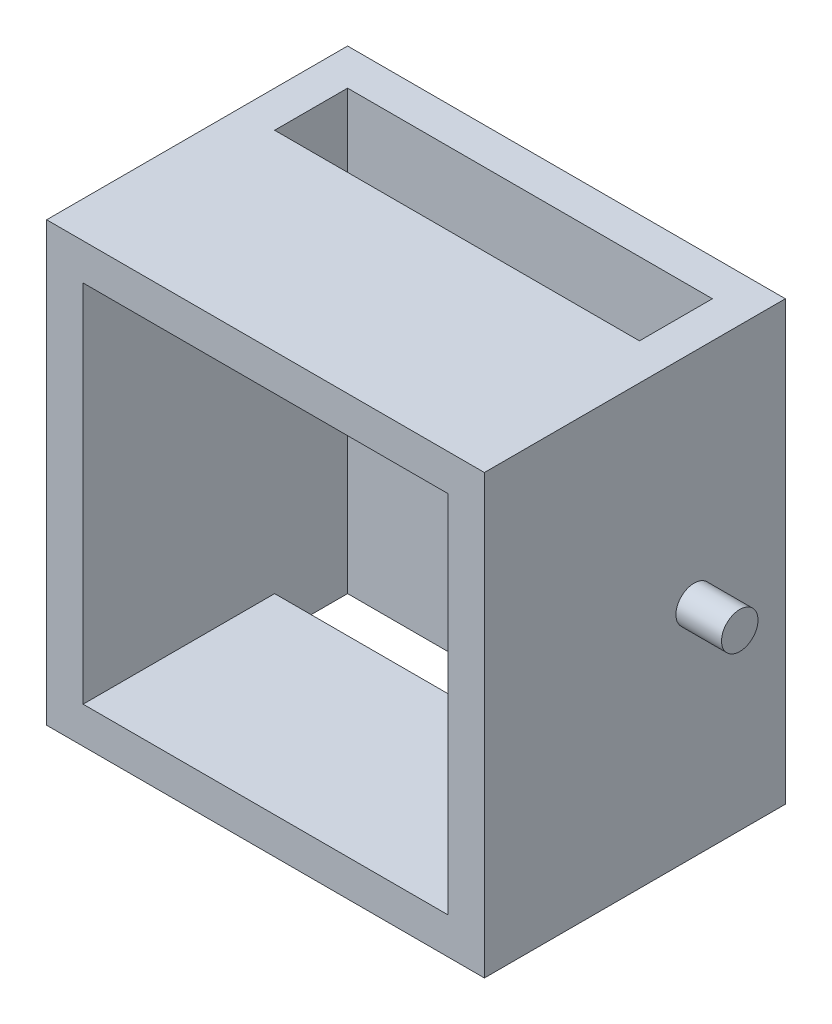
ISO-10303-21;
HEADER;
FILE_DESCRIPTION(('STEP AP214'),'2;1');
FILE_NAME('part.step','',(''),(''),'','','');
FILE_SCHEMA(('AUTOMOTIVE_DESIGN { 1 0 10303 214 1 1 1 1 }'));
ENDSEC;
DATA;
#1=APPLICATION_CONTEXT('core data for automotive mechanical design processes');
#2=APPLICATION_PROTOCOL_DEFINITION('international standard','automotive_design',2000,#1);
#3=PRODUCT_CONTEXT('',#1,'mechanical');
#4=PRODUCT('Part','Part','',(#3));
#5=PRODUCT_RELATED_PRODUCT_CATEGORY('part','',(#4));
#6=PRODUCT_DEFINITION_FORMATION('','',#4);
#7=PRODUCT_DEFINITION_CONTEXT('part definition',#1,'design');
#8=PRODUCT_DEFINITION('design','',#6,#7);
#9=PRODUCT_DEFINITION_SHAPE('','',#8);
#10=(LENGTH_UNIT() NAMED_UNIT(*) SI_UNIT(.MILLI.,.METRE.));
#11=(NAMED_UNIT(*) PLANE_ANGLE_UNIT() SI_UNIT($,.RADIAN.));
#12=(NAMED_UNIT(*) SI_UNIT($,.STERADIAN.) SOLID_ANGLE_UNIT());
#13=UNCERTAINTY_MEASURE_WITH_UNIT(LENGTH_MEASURE(1.E-05),#10,'distance_accuracy_value','');
#14=(GEOMETRIC_REPRESENTATION_CONTEXT(3) GLOBAL_UNCERTAINTY_ASSIGNED_CONTEXT((#13)) GLOBAL_UNIT_ASSIGNED_CONTEXT((#10,
#11,#12)) REPRESENTATION_CONTEXT('',''));
#15=CARTESIAN_POINT('',(0.,0.,0.));
#16=DIRECTION('',(0.,0.,1.));
#17=DIRECTION('',(1.,0.,0.));
#18=AXIS2_PLACEMENT_3D('',#15,#16,#17);
#19=CARTESIAN_POINT('',(0.,0.,33.));
#20=DIRECTION('',(0.,0.,-1.));
#21=DIRECTION('',(-1.,0.,0.));
#22=AXIS2_PLACEMENT_3D('',#19,#20,#21);
#23=PLANE('',#22);
#24=DIRECTION('',(0.,1.,0.));
#25=VECTOR('',#24,1.);
#26=CARTESIAN_POINT('',(24.,-24.,33.));
#27=LINE('',#26,#25);
#28=CARTESIAN_POINT('',(24.,-24.,33.));
#29=VERTEX_POINT('',#28);
#30=CARTESIAN_POINT('',(24.,24.,33.));
#31=VERTEX_POINT('',#30);
#32=EDGE_CURVE('E186',#29,#31,#27,.T.);
#33=ORIENTED_EDGE('',*,*,#32,.T.);
#34=DIRECTION('',(-1.,0.,0.));
#35=VECTOR('',#34,1.);
#36=CARTESIAN_POINT('',(-24.,24.,33.));
#37=LINE('',#36,#35);
#38=CARTESIAN_POINT('',(-24.,24.,33.));
#39=VERTEX_POINT('',#38);
#40=EDGE_CURVE('E189',#31,#39,#37,.T.);
#41=ORIENTED_EDGE('',*,*,#40,.T.);
#42=DIRECTION('',(0.,-1.,0.));
#43=VECTOR('',#42,1.);
#44=CARTESIAN_POINT('',(-24.,-24.,33.));
#45=LINE('',#44,#43);
#46=CARTESIAN_POINT('',(-24.,-24.,33.));
#47=VERTEX_POINT('',#46);
#48=EDGE_CURVE('E192',#39,#47,#45,.T.);
#49=ORIENTED_EDGE('',*,*,#48,.T.);
#50=DIRECTION('',(1.,0.,0.));
#51=VECTOR('',#50,1.);
#52=CARTESIAN_POINT('',(-24.,-24.,33.));
#53=LINE('',#52,#51);
#54=EDGE_CURVE('E194',#47,#29,#53,.T.);
#55=ORIENTED_EDGE('',*,*,#54,.T.);
#56=EDGE_LOOP('',(#33,#41,#49,#55));
#57=FACE_BOUND('',#56,.T.);
#58=DIRECTION('',(0.,1.,0.));
#59=VECTOR('',#58,1.);
#60=CARTESIAN_POINT('',(20.,0.,33.));
#61=LINE('',#60,#59);
#62=CARTESIAN_POINT('',(20.,-20.,33.));
#63=VERTEX_POINT('',#62);
#64=CARTESIAN_POINT('',(20.,20.,33.));
#65=VERTEX_POINT('',#64);
#66=EDGE_CURVE('E176',#63,#65,#61,.T.);
#67=ORIENTED_EDGE('',*,*,#66,.F.);
#68=DIRECTION('',(1.,0.,0.));
#69=VECTOR('',#68,1.);
#70=CARTESIAN_POINT('',(0.,-20.,33.));
#71=LINE('',#70,#69);
#72=CARTESIAN_POINT('',(-20.,-20.,33.));
#73=VERTEX_POINT('',#72);
#74=EDGE_CURVE('E172',#73,#63,#71,.T.);
#75=ORIENTED_EDGE('',*,*,#74,.F.);
#76=DIRECTION('',(0.,-1.,0.));
#77=VECTOR('',#76,1.);
#78=CARTESIAN_POINT('',(-20.,0.,33.));
#79=LINE('',#78,#77);
#80=CARTESIAN_POINT('',(-20.,20.,33.));
#81=VERTEX_POINT('',#80);
#82=EDGE_CURVE('E182',#81,#73,#79,.T.);
#83=ORIENTED_EDGE('',*,*,#82,.F.);
#84=DIRECTION('',(-1.,0.,0.));
#85=VECTOR('',#84,1.);
#86=CARTESIAN_POINT('',(0.,20.,33.));
#87=LINE('',#86,#85);
#88=EDGE_CURVE('E180',#65,#81,#87,.T.);
#89=ORIENTED_EDGE('',*,*,#88,.F.);
#90=EDGE_LOOP('',(#67,#75,#83,#89));
#91=FACE_BOUND('',#90,.T.);
#92=ADVANCED_FACE('F32',(#57,#91),#23,.F.);
#93=CARTESIAN_POINT('',(24.,-24.,33.));
#94=DIRECTION('',(-1.,0.,0.));
#95=DIRECTION('',(0.,0.,1.));
#96=AXIS2_PLACEMENT_3D('',#93,#94,#95);
#97=PLANE('',#96);
#98=CARTESIAN_POINT('',(24.,0.,10.));
#99=DIRECTION('',(-1.,0.,0.));
#100=DIRECTION('',(0.,0.,1.));
#101=AXIS2_PLACEMENT_3D('',#98,#99,#100);
#102=CIRCLE('',#101,2.);
#103=CARTESIAN_POINT('',(24.,0.,12.));
#104=VERTEX_POINT('',#103);
#105=EDGE_CURVE('E11',#104,#104,#102,.F.);
#106=ORIENTED_EDGE('',*,*,#105,.F.);
#107=EDGE_LOOP('',(#106));
#108=FACE_BOUND('',#107,.T.);
#109=DIRECTION('',(0.,1.,0.));
#110=VECTOR('',#109,1.);
#111=CARTESIAN_POINT('',(24.,-24.,0.));
#112=LINE('',#111,#110);
#113=CARTESIAN_POINT('',(24.,-24.,0.));
#114=VERTEX_POINT('',#113);
#115=CARTESIAN_POINT('',(24.,24.,0.));
#116=VERTEX_POINT('',#115);
#117=EDGE_CURVE('E166',#114,#116,#112,.T.);
#118=ORIENTED_EDGE('',*,*,#117,.T.);
#119=DIRECTION('',(0.,0.,-1.));
#120=VECTOR('',#119,1.);
#121=CARTESIAN_POINT('',(24.,24.,33.));
#122=LINE('',#121,#120);
#123=EDGE_CURVE('E212',#31,#116,#122,.T.);
#124=ORIENTED_EDGE('',*,*,#123,.F.);
#125=ORIENTED_EDGE('',*,*,#32,.F.);
#126=DIRECTION('',(0.,0.,-1.));
#127=VECTOR('',#126,1.);
#128=CARTESIAN_POINT('',(24.,-24.,33.));
#129=LINE('',#128,#127);
#130=EDGE_CURVE('E196',#29,#114,#129,.T.);
#131=ORIENTED_EDGE('',*,*,#130,.T.);
#132=EDGE_LOOP('',(#118,#124,#125,#131));
#133=FACE_BOUND('',#132,.T.);
#134=ADVANCED_FACE('F34',(#108,#133),#97,.F.);
#135=CARTESIAN_POINT('',(-24.,24.,33.));
#136=DIRECTION('',(0.,-1.,0.));
#137=DIRECTION('',(0.,0.,-1.));
#138=AXIS2_PLACEMENT_3D('',#135,#136,#137);
#139=PLANE('',#138);
#140=DIRECTION('',(-1.,0.,0.));
#141=VECTOR('',#140,1.);
#142=CARTESIAN_POINT('',(-20.,24.,4.));
#143=LINE('',#142,#141);
#144=CARTESIAN_POINT('',(20.,24.,3.99999999999999));
#145=VERTEX_POINT('',#144);
#146=CARTESIAN_POINT('',(-20.,24.,4.));
#147=VERTEX_POINT('',#146);
#148=EDGE_CURVE('E154',#145,#147,#143,.T.);
#149=ORIENTED_EDGE('',*,*,#148,.F.);
#150=DIRECTION('',(0.,0.,-1.));
#151=VECTOR('',#150,1.);
#152=CARTESIAN_POINT('',(20.,24.,12.));
#153=LINE('',#152,#151);
#154=CARTESIAN_POINT('',(20.,24.,12.));
#155=VERTEX_POINT('',#154);
#156=EDGE_CURVE('E126',#155,#145,#153,.T.);
#157=ORIENTED_EDGE('',*,*,#156,.F.);
#158=DIRECTION('',(1.,0.,0.));
#159=VECTOR('',#158,1.);
#160=CARTESIAN_POINT('',(-20.,24.,12.));
#161=LINE('',#160,#159);
#162=CARTESIAN_POINT('',(-20.,24.,12.));
#163=VERTEX_POINT('',#162);
#164=EDGE_CURVE('E141',#163,#155,#161,.T.);
#165=ORIENTED_EDGE('',*,*,#164,.F.);
#166=DIRECTION('',(0.,0.,1.));
#167=VECTOR('',#166,1.);
#168=CARTESIAN_POINT('',(-20.,24.,12.));
#169=LINE('',#168,#167);
#170=EDGE_CURVE('E144',#147,#163,#169,.T.);
#171=ORIENTED_EDGE('',*,*,#170,.F.);
#172=EDGE_LOOP('',(#149,#157,#165,#171));
#173=FACE_BOUND('',#172,.T.);
#174=DIRECTION('',(-1.,0.,0.));
#175=VECTOR('',#174,1.);
#176=CARTESIAN_POINT('',(-24.,24.,0.));
#177=LINE('',#176,#175);
#178=CARTESIAN_POINT('',(-24.,24.,0.));
#179=VERTEX_POINT('',#178);
#180=EDGE_CURVE('E199',#116,#179,#177,.T.);
#181=ORIENTED_EDGE('',*,*,#180,.T.);
#182=DIRECTION('',(0.,0.,-1.));
#183=VECTOR('',#182,1.);
#184=CARTESIAN_POINT('',(-24.,24.,33.));
#185=LINE('',#184,#183);
#186=EDGE_CURVE('E209',#39,#179,#185,.T.);
#187=ORIENTED_EDGE('',*,*,#186,.F.);
#188=ORIENTED_EDGE('',*,*,#40,.F.);
#189=ORIENTED_EDGE('',*,*,#123,.T.);
#190=EDGE_LOOP('',(#181,#187,#188,#189));
#191=FACE_BOUND('',#190,.T.);
#192=ADVANCED_FACE('F238',(#173,#191),#139,.F.);
#193=CARTESIAN_POINT('',(-24.,-24.,33.));
#194=DIRECTION('',(1.,0.,0.));
#195=DIRECTION('',(0.,0.,-1.));
#196=AXIS2_PLACEMENT_3D('',#193,#194,#195);
#197=PLANE('',#196);
#198=CARTESIAN_POINT('',(-24.,0.,10.));
#199=DIRECTION('',(1.,0.,0.));
#200=DIRECTION('',(0.,0.,-1.));
#201=AXIS2_PLACEMENT_3D('',#198,#199,#200);
#202=CIRCLE('',#201,2.);
#203=CARTESIAN_POINT('',(-24.,0.,8.));
#204=VERTEX_POINT('',#203);
#205=EDGE_CURVE('E276',#204,#204,#202,.T.);
#206=ORIENTED_EDGE('',*,*,#205,.T.);
#207=EDGE_LOOP('',(#206));
#208=FACE_BOUND('',#207,.T.);
#209=DIRECTION('',(0.,-1.,0.));
#210=VECTOR('',#209,1.);
#211=CARTESIAN_POINT('',(-24.,-24.,0.));
#212=LINE('',#211,#210);
#213=CARTESIAN_POINT('',(-24.,-24.,0.));
#214=VERTEX_POINT('',#213);
#215=EDGE_CURVE('E201',#179,#214,#212,.T.);
#216=ORIENTED_EDGE('',*,*,#215,.T.);
#217=DIRECTION('',(0.,0.,-1.));
#218=VECTOR('',#217,1.);
#219=CARTESIAN_POINT('',(-24.,-24.,33.));
#220=LINE('',#219,#218);
#221=EDGE_CURVE('E206',#47,#214,#220,.T.);
#222=ORIENTED_EDGE('',*,*,#221,.F.);
#223=ORIENTED_EDGE('',*,*,#48,.F.);
#224=ORIENTED_EDGE('',*,*,#186,.T.);
#225=EDGE_LOOP('',(#216,#222,#223,#224));
#226=FACE_BOUND('',#225,.T.);
#227=ADVANCED_FACE('F241',(#208,#226),#197,.F.);
#228=CARTESIAN_POINT('',(-24.,-24.,33.));
#229=DIRECTION('',(0.,1.,0.));
#230=DIRECTION('',(0.,0.,1.));
#231=AXIS2_PLACEMENT_3D('',#228,#229,#230);
#232=PLANE('',#231);
#233=DIRECTION('',(1.,0.,0.));
#234=VECTOR('',#233,1.);
#235=CARTESIAN_POINT('',(-20.,-24.,12.));
#236=LINE('',#235,#234);
#237=CARTESIAN_POINT('',(-20.,-24.,12.));
#238=VERTEX_POINT('',#237);
#239=CARTESIAN_POINT('',(20.,-24.,12.));
#240=VERTEX_POINT('',#239);
#241=EDGE_CURVE('E140',#238,#240,#236,.T.);
#242=ORIENTED_EDGE('',*,*,#241,.T.);
#243=DIRECTION('',(0.,0.,-1.));
#244=VECTOR('',#243,1.);
#245=CARTESIAN_POINT('',(20.,-24.,12.));
#246=LINE('',#245,#244);
#247=CARTESIAN_POINT('',(20.,-24.,3.99999999999999));
#248=VERTEX_POINT('',#247);
#249=EDGE_CURVE('E123',#240,#248,#246,.T.);
#250=ORIENTED_EDGE('',*,*,#249,.T.);
#251=DIRECTION('',(-1.,0.,0.));
#252=VECTOR('',#251,1.);
#253=CARTESIAN_POINT('',(-20.,-24.,4.));
#254=LINE('',#253,#252);
#255=CARTESIAN_POINT('',(-20.,-24.,4.));
#256=VERTEX_POINT('',#255);
#257=EDGE_CURVE('E131',#248,#256,#254,.T.);
#258=ORIENTED_EDGE('',*,*,#257,.T.);
#259=DIRECTION('',(0.,0.,1.));
#260=VECTOR('',#259,1.);
#261=CARTESIAN_POINT('',(-20.,-24.,12.));
#262=LINE('',#261,#260);
#263=EDGE_CURVE('E135',#256,#238,#262,.T.);
#264=ORIENTED_EDGE('',*,*,#263,.T.);
#265=EDGE_LOOP('',(#242,#250,#258,#264));
#266=FACE_BOUND('',#265,.T.);
#267=DIRECTION('',(1.,0.,0.));
#268=VECTOR('',#267,1.);
#269=CARTESIAN_POINT('',(-24.,-24.,0.));
#270=LINE('',#269,#268);
#271=EDGE_CURVE('E190',#214,#114,#270,.T.);
#272=ORIENTED_EDGE('',*,*,#271,.T.);
#273=ORIENTED_EDGE('',*,*,#130,.F.);
#274=ORIENTED_EDGE('',*,*,#54,.F.);
#275=ORIENTED_EDGE('',*,*,#221,.T.);
#276=EDGE_LOOP('',(#272,#273,#274,#275));
#277=FACE_BOUND('',#276,.T.);
#278=ADVANCED_FACE('F137',(#266,#277),#232,.F.);
#279=CARTESIAN_POINT('',(0.,0.,0.));
#280=DIRECTION('',(0.,0.,-1.));
#281=DIRECTION('',(-1.,0.,0.));
#282=AXIS2_PLACEMENT_3D('',#279,#280,#281);
#283=PLANE('',#282);
#284=ORIENTED_EDGE('',*,*,#117,.F.);
#285=ORIENTED_EDGE('',*,*,#271,.F.);
#286=ORIENTED_EDGE('',*,*,#215,.F.);
#287=ORIENTED_EDGE('',*,*,#180,.F.);
#288=EDGE_LOOP('',(#284,#285,#286,#287));
#289=FACE_BOUND('',#288,.T.);
#290=ADVANCED_FACE('F251',(#289),#283,.T.);
#291=CARTESIAN_POINT('',(20.,-24.,33.));
#292=DIRECTION('',(-1.,0.,0.));
#293=DIRECTION('',(0.,0.,1.));
#294=AXIS2_PLACEMENT_3D('',#291,#292,#293);
#295=PLANE('',#294);
#296=DIRECTION('',(0.,0.,-1.));
#297=VECTOR('',#296,1.);
#298=CARTESIAN_POINT('',(20.,20.,33.));
#299=LINE('',#298,#297);
#300=CARTESIAN_POINT('',(20.,20.,12.));
#301=VERTEX_POINT('',#300);
#302=EDGE_CURVE('E164',#65,#301,#299,.T.);
#303=ORIENTED_EDGE('',*,*,#302,.T.);
#304=DIRECTION('',(0.,1.,0.));
#305=VECTOR('',#304,1.);
#306=CARTESIAN_POINT('',(20.,-24.,12.));
#307=LINE('',#306,#305);
#308=EDGE_CURVE('E160',#301,#155,#307,.T.);
#309=ORIENTED_EDGE('',*,*,#308,.T.);
#310=ORIENTED_EDGE('',*,*,#156,.T.);
#311=DIRECTION('',(0.,1.,0.));
#312=VECTOR('',#311,1.);
#313=CARTESIAN_POINT('',(20.,0.,4.));
#314=LINE('',#313,#312);
#315=EDGE_CURVE('E47',#248,#145,#314,.T.);
#316=ORIENTED_EDGE('',*,*,#315,.F.);
#317=ORIENTED_EDGE('',*,*,#249,.F.);
#318=CARTESIAN_POINT('',(20.,-20.,12.));
#319=VERTEX_POINT('',#318);
#320=EDGE_CURVE('E158',#240,#319,#307,.T.);
#321=ORIENTED_EDGE('',*,*,#320,.T.);
#322=DIRECTION('',(0.,0.,-1.));
#323=VECTOR('',#322,1.);
#324=CARTESIAN_POINT('',(20.,-20.,33.));
#325=LINE('',#324,#323);
#326=EDGE_CURVE('E168',#63,#319,#325,.T.);
#327=ORIENTED_EDGE('',*,*,#326,.F.);
#328=ORIENTED_EDGE('',*,*,#66,.T.);
#329=EDGE_LOOP('',(#303,#309,#310,#316,#317,#321,#327,#328));
#330=FACE_BOUND('',#329,.T.);
#331=ADVANCED_FACE('F120',(#330),#295,.T.);
#332=CARTESIAN_POINT('',(-24.,20.,33.));
#333=DIRECTION('',(0.,-1.,0.));
#334=DIRECTION('',(0.,0.,-1.));
#335=AXIS2_PLACEMENT_3D('',#332,#333,#334);
#336=PLANE('',#335);
#337=DIRECTION('',(-1.,0.,0.));
#338=VECTOR('',#337,1.);
#339=CARTESIAN_POINT('',(-24.,20.,12.));
#340=LINE('',#339,#338);
#341=CARTESIAN_POINT('',(-20.,20.,12.));
#342=VERTEX_POINT('',#341);
#343=EDGE_CURVE('E128',#301,#342,#340,.T.);
#344=ORIENTED_EDGE('',*,*,#343,.F.);
#345=ORIENTED_EDGE('',*,*,#302,.F.);
#346=ORIENTED_EDGE('',*,*,#88,.T.);
#347=DIRECTION('',(0.,0.,-1.));
#348=VECTOR('',#347,1.);
#349=CARTESIAN_POINT('',(-20.,20.,33.));
#350=LINE('',#349,#348);
#351=EDGE_CURVE('E167',#81,#342,#350,.T.);
#352=ORIENTED_EDGE('',*,*,#351,.T.);
#353=EDGE_LOOP('',(#344,#345,#346,#352));
#354=FACE_BOUND('',#353,.T.);
#355=ADVANCED_FACE('F228',(#354),#336,.T.);
#356=CARTESIAN_POINT('',(-20.,-24.,33.));
#357=DIRECTION('',(1.,0.,0.));
#358=DIRECTION('',(0.,0.,-1.));
#359=AXIS2_PLACEMENT_3D('',#356,#357,#358);
#360=PLANE('',#359);
#361=DIRECTION('',(0.,0.,-1.));
#362=VECTOR('',#361,1.);
#363=CARTESIAN_POINT('',(-20.,-20.,33.));
#364=LINE('',#363,#362);
#365=CARTESIAN_POINT('',(-20.,-20.,12.));
#366=VERTEX_POINT('',#365);
#367=EDGE_CURVE('E171',#73,#366,#364,.T.);
#368=ORIENTED_EDGE('',*,*,#367,.T.);
#369=DIRECTION('',(0.,1.,0.));
#370=VECTOR('',#369,1.);
#371=CARTESIAN_POINT('',(-20.,-24.,12.));
#372=LINE('',#371,#370);
#373=EDGE_CURVE('E161',#238,#366,#372,.T.);
#374=ORIENTED_EDGE('',*,*,#373,.F.);
#375=ORIENTED_EDGE('',*,*,#263,.F.);
#376=DIRECTION('',(0.,-1.,0.));
#377=VECTOR('',#376,1.);
#378=CARTESIAN_POINT('',(-20.,0.,4.));
#379=LINE('',#378,#377);
#380=EDGE_CURVE('E52',#147,#256,#379,.T.);
#381=ORIENTED_EDGE('',*,*,#380,.F.);
#382=ORIENTED_EDGE('',*,*,#170,.T.);
#383=EDGE_CURVE('E152',#342,#163,#372,.T.);
#384=ORIENTED_EDGE('',*,*,#383,.F.);
#385=ORIENTED_EDGE('',*,*,#351,.F.);
#386=ORIENTED_EDGE('',*,*,#82,.T.);
#387=EDGE_LOOP('',(#368,#374,#375,#381,#382,#384,#385,#386));
#388=FACE_BOUND('',#387,.T.);
#389=ADVANCED_FACE('F234',(#388),#360,.T.);
#390=CARTESIAN_POINT('',(-24.,-20.,33.));
#391=DIRECTION('',(0.,1.,0.));
#392=DIRECTION('',(0.,0.,1.));
#393=AXIS2_PLACEMENT_3D('',#390,#391,#392);
#394=PLANE('',#393);
#395=DIRECTION('',(1.,0.,0.));
#396=VECTOR('',#395,1.);
#397=CARTESIAN_POINT('',(-24.,-20.,12.));
#398=LINE('',#397,#396);
#399=EDGE_CURVE('E40',#366,#319,#398,.T.);
#400=ORIENTED_EDGE('',*,*,#399,.F.);
#401=ORIENTED_EDGE('',*,*,#367,.F.);
#402=ORIENTED_EDGE('',*,*,#74,.T.);
#403=ORIENTED_EDGE('',*,*,#326,.T.);
#404=EDGE_LOOP('',(#400,#401,#402,#403));
#405=FACE_BOUND('',#404,.T.);
#406=ADVANCED_FACE('F220',(#405),#394,.T.);
#407=CARTESIAN_POINT('',(0.,0.,4.));
#408=DIRECTION('',(0.,0.,-1.));
#409=DIRECTION('',(-1.,0.,0.));
#410=AXIS2_PLACEMENT_3D('',#407,#408,#409);
#411=PLANE('',#410);
#412=ORIENTED_EDGE('',*,*,#315,.T.);
#413=ORIENTED_EDGE('',*,*,#148,.T.);
#414=ORIENTED_EDGE('',*,*,#380,.T.);
#415=ORIENTED_EDGE('',*,*,#257,.F.);
#416=EDGE_LOOP('',(#412,#413,#414,#415));
#417=FACE_BOUND('',#416,.T.);
#418=ADVANCED_FACE('F132',(#417),#411,.F.);
#419=CARTESIAN_POINT('',(-20.,-24.,12.));
#420=DIRECTION('',(0.,0.,1.));
#421=DIRECTION('',(1.,0.,0.));
#422=AXIS2_PLACEMENT_3D('',#419,#420,#421);
#423=PLANE('',#422);
#424=ORIENTED_EDGE('',*,*,#399,.T.);
#425=ORIENTED_EDGE('',*,*,#320,.F.);
#426=ORIENTED_EDGE('',*,*,#241,.F.);
#427=ORIENTED_EDGE('',*,*,#373,.T.);
#428=EDGE_LOOP('',(#424,#425,#426,#427));
#429=FACE_BOUND('',#428,.T.);
#430=ADVANCED_FACE('F216',(#429),#423,.F.);
#431=ORIENTED_EDGE('',*,*,#343,.T.);
#432=ORIENTED_EDGE('',*,*,#383,.T.);
#433=ORIENTED_EDGE('',*,*,#164,.T.);
#434=ORIENTED_EDGE('',*,*,#308,.F.);
#435=EDGE_LOOP('',(#431,#432,#433,#434));
#436=FACE_BOUND('',#435,.T.);
#437=ADVANCED_FACE('F232',(#436),#423,.F.);
#438=CARTESIAN_POINT('',(29.,0.,10.));
#439=DIRECTION('',(-1.,0.,0.));
#440=DIRECTION('',(0.,0.,1.));
#441=AXIS2_PLACEMENT_3D('',#438,#439,#440);
#442=CYLINDRICAL_SURFACE('',#441,2.);
#443=CARTESIAN_POINT('',(29.,0.,10.));
#444=DIRECTION('',(1.,0.,0.));
#445=DIRECTION('',(0.,0.,-1.));
#446=AXIS2_PLACEMENT_3D('',#443,#444,#445);
#447=CIRCLE('',#446,2.);
#448=CARTESIAN_POINT('',(29.,0.,8.));
#449=VERTEX_POINT('',#448);
#450=EDGE_CURVE('E147',#449,#449,#447,.T.);
#451=ORIENTED_EDGE('',*,*,#450,.F.);
#452=EDGE_LOOP('',(#451));
#453=FACE_BOUND('',#452,.T.);
#454=ORIENTED_EDGE('',*,*,#105,.T.);
#455=EDGE_LOOP('',(#454));
#456=FACE_BOUND('',#455,.T.);
#457=ADVANCED_FACE('F288',(#453,#456),#442,.T.);
#458=CARTESIAN_POINT('',(29.,0.,10.));
#459=DIRECTION('',(1.,0.,0.));
#460=DIRECTION('',(0.,0.,-1.));
#461=AXIS2_PLACEMENT_3D('',#458,#459,#460);
#462=PLANE('',#461);
#463=ORIENTED_EDGE('',*,*,#450,.T.);
#464=EDGE_LOOP('',(#463));
#465=FACE_BOUND('',#464,.T.);
#466=ADVANCED_FACE('F286',(#465),#462,.T.);
#467=CARTESIAN_POINT('',(-29.,0.,10.));
#468=DIRECTION('',(1.,0.,0.));
#469=DIRECTION('',(0.,0.,-1.));
#470=AXIS2_PLACEMENT_3D('',#467,#468,#469);
#471=CYLINDRICAL_SURFACE('',#470,2.);
#472=CARTESIAN_POINT('',(-29.,0.,10.));
#473=DIRECTION('',(1.,0.,0.));
#474=DIRECTION('',(0.,0.,-1.));
#475=AXIS2_PLACEMENT_3D('',#472,#473,#474);
#476=CIRCLE('',#475,2.);
#477=CARTESIAN_POINT('',(-29.,0.,8.));
#478=VERTEX_POINT('',#477);
#479=EDGE_CURVE('E278',#478,#478,#476,.T.);
#480=ORIENTED_EDGE('',*,*,#479,.T.);
#481=EDGE_LOOP('',(#480));
#482=FACE_BOUND('',#481,.T.);
#483=ORIENTED_EDGE('',*,*,#205,.F.);
#484=EDGE_LOOP('',(#483));
#485=FACE_BOUND('',#484,.T.);
#486=ADVANCED_FACE('F297',(#482,#485),#471,.T.);
#487=CARTESIAN_POINT('',(-29.,0.,10.));
#488=DIRECTION('',(-1.,0.,0.));
#489=DIRECTION('',(0.,0.,-1.));
#490=AXIS2_PLACEMENT_3D('',#487,#488,#489);
#491=PLANE('',#490);
#492=ORIENTED_EDGE('',*,*,#479,.F.);
#493=EDGE_LOOP('',(#492));
#494=FACE_BOUND('',#493,.T.);
#495=ADVANCED_FACE('F353',(#494),#491,.T.);
#496=CLOSED_SHELL('',(#92,#134,#192,#227,#278,#290,#331,#355,#389,#406,#418,#430,#437,#457,#466,
#486,#495));
#497=MANIFOLD_SOLID_BREP('B2',#496);
#498=ADVANCED_BREP_SHAPE_REPRESENTATION('',(#18,#497),#14);
#499=SHAPE_DEFINITION_REPRESENTATION(#9,#498);
ENDSEC;
END-ISO-10303-21;
